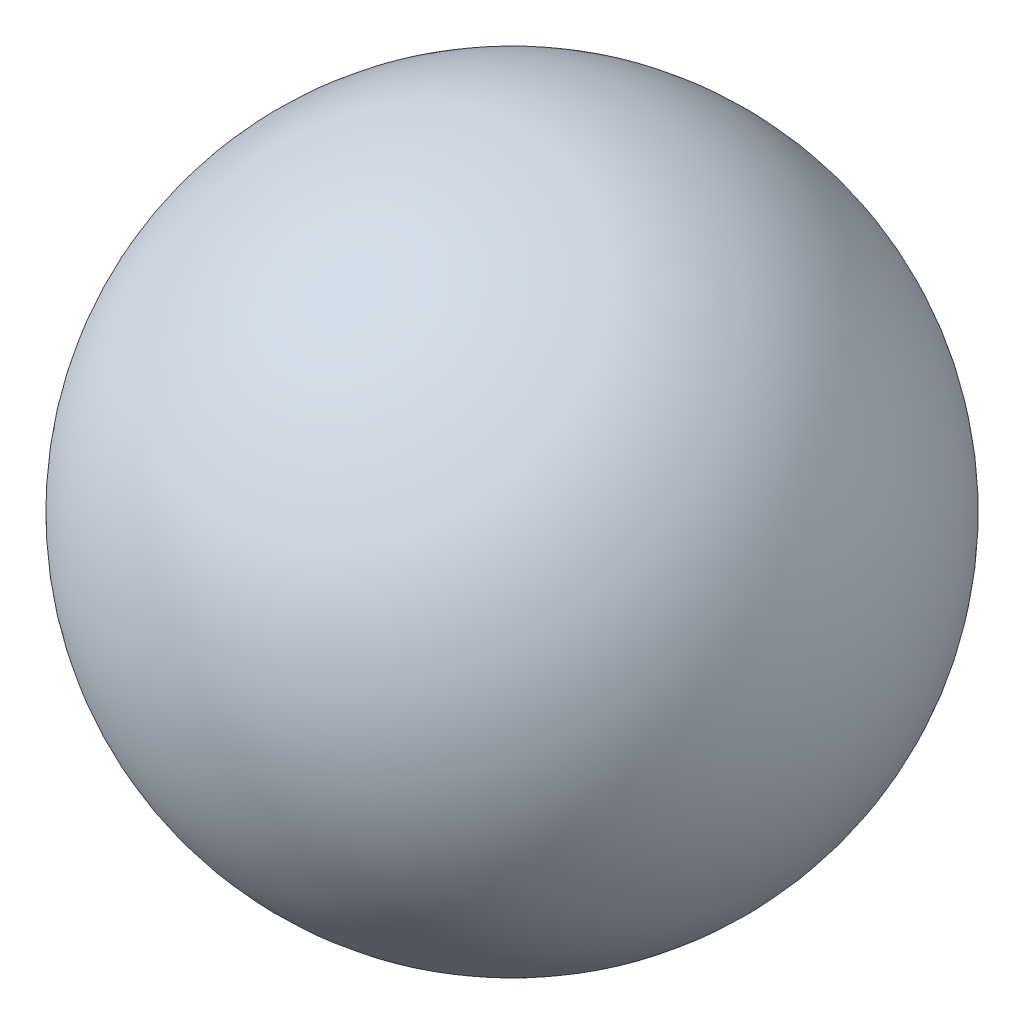
ISO-10303-21;
HEADER;
FILE_DESCRIPTION(('STEP AP214'),'2;1');
FILE_NAME('part.step','',(''),(''),'','','');
FILE_SCHEMA(('AUTOMOTIVE_DESIGN { 1 0 10303 214 1 1 1 1 }'));
ENDSEC;
DATA;
#1=APPLICATION_CONTEXT('core data for automotive mechanical design processes');
#2=APPLICATION_PROTOCOL_DEFINITION('international standard','automotive_design',2000,#1);
#3=PRODUCT_CONTEXT('',#1,'mechanical');
#4=PRODUCT('Part','Part','',(#3));
#5=PRODUCT_RELATED_PRODUCT_CATEGORY('part','',(#4));
#6=PRODUCT_DEFINITION_FORMATION('','',#4);
#7=PRODUCT_DEFINITION_CONTEXT('part definition',#1,'design');
#8=PRODUCT_DEFINITION('design','',#6,#7);
#9=PRODUCT_DEFINITION_SHAPE('','',#8);
#10=(LENGTH_UNIT() NAMED_UNIT(*) SI_UNIT(.MILLI.,.METRE.));
#11=(NAMED_UNIT(*) PLANE_ANGLE_UNIT() SI_UNIT($,.RADIAN.));
#12=(NAMED_UNIT(*) SI_UNIT($,.STERADIAN.) SOLID_ANGLE_UNIT());
#13=UNCERTAINTY_MEASURE_WITH_UNIT(LENGTH_MEASURE(1.E-05),#10,'distance_accuracy_value','');
#14=(GEOMETRIC_REPRESENTATION_CONTEXT(3) GLOBAL_UNCERTAINTY_ASSIGNED_CONTEXT((#13)) GLOBAL_UNIT_ASSIGNED_CONTEXT((#10,
#11,#12)) REPRESENTATION_CONTEXT('',''));
#15=CARTESIAN_POINT('',(0.,0.,0.));
#16=DIRECTION('',(0.,0.,1.));
#17=DIRECTION('',(1.,0.,0.));
#18=AXIS2_PLACEMENT_3D('',#15,#16,#17);
#19=CARTESIAN_POINT('',(0.,0.,0.));
#20=DIRECTION('',(0.,1.,0.));
#21=DIRECTION('',(1.,0.,0.));
#22=AXIS2_PLACEMENT_3D('',#19,#20,#21);
#23=SPHERICAL_SURFACE('',#22,21.);
#24=CARTESIAN_POINT('',(0.,21.,0.));
#25=VERTEX_POINT('',#24);
#26=VERTEX_LOOP('',#25);
#27=FACE_BOUND('',#26,.T.);
#28=ADVANCED_FACE('F32',(#27),#23,.T.);
#29=CLOSED_SHELL('',(#28));
#30=MANIFOLD_SOLID_BREP('B2',#29);
#31=ADVANCED_BREP_SHAPE_REPRESENTATION('',(#18,#30),#14);
#32=SHAPE_DEFINITION_REPRESENTATION(#9,#31);
ENDSEC;
END-ISO-10303-21;
